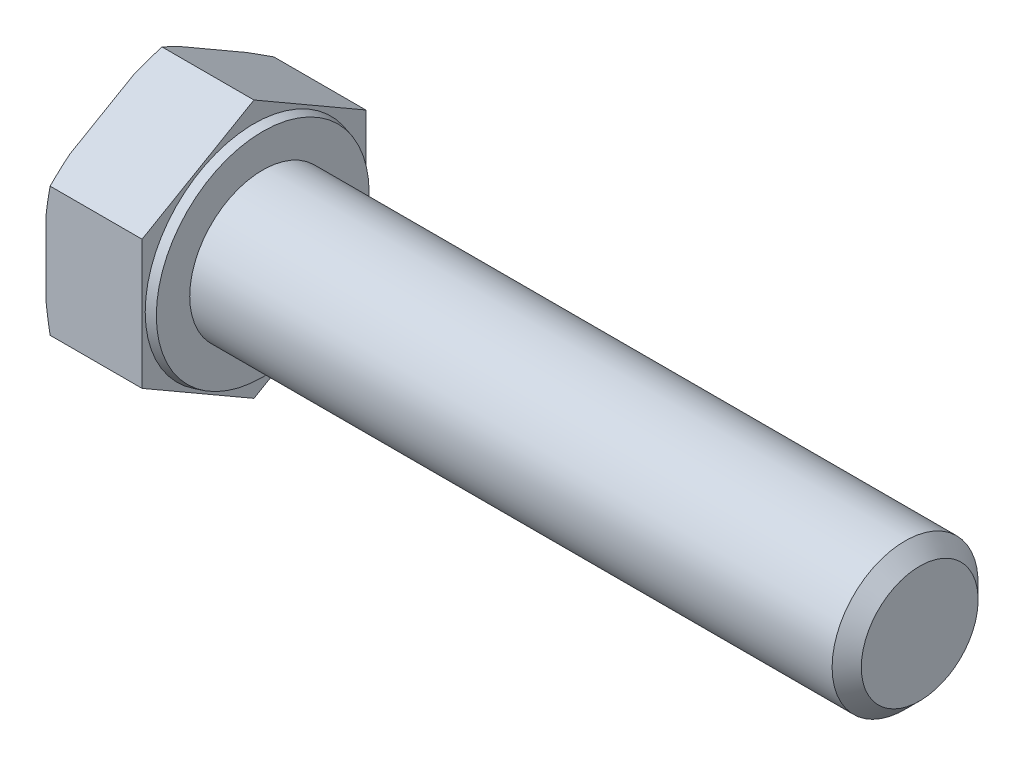
ISO-10303-21;
HEADER;
FILE_DESCRIPTION(('STEP AP214'),'2;1');
FILE_NAME('part.step','',(''),(''),'','','');
FILE_SCHEMA(('AUTOMOTIVE_DESIGN { 1 0 10303 214 1 1 1 1 }'));
ENDSEC;
DATA;
#1=APPLICATION_CONTEXT('core data for automotive mechanical design processes');
#2=APPLICATION_PROTOCOL_DEFINITION('international standard','automotive_design',2000,#1);
#3=PRODUCT_CONTEXT('',#1,'mechanical');
#4=PRODUCT('Part','Part','',(#3));
#5=PRODUCT_RELATED_PRODUCT_CATEGORY('part','',(#4));
#6=PRODUCT_DEFINITION_FORMATION('','',#4);
#7=PRODUCT_DEFINITION_CONTEXT('part definition',#1,'design');
#8=PRODUCT_DEFINITION('design','',#6,#7);
#9=PRODUCT_DEFINITION_SHAPE('','',#8);
#10=(LENGTH_UNIT() NAMED_UNIT(*) SI_UNIT(.MILLI.,.METRE.));
#11=(NAMED_UNIT(*) PLANE_ANGLE_UNIT() SI_UNIT($,.RADIAN.));
#12=(NAMED_UNIT(*) SI_UNIT($,.STERADIAN.) SOLID_ANGLE_UNIT());
#13=UNCERTAINTY_MEASURE_WITH_UNIT(LENGTH_MEASURE(1.E-05),#10,'distance_accuracy_value','');
#14=(GEOMETRIC_REPRESENTATION_CONTEXT(3) GLOBAL_UNCERTAINTY_ASSIGNED_CONTEXT((#13)) GLOBAL_UNIT_ASSIGNED_CONTEXT((#10,
#11,#12)) REPRESENTATION_CONTEXT('',''));
#15=CARTESIAN_POINT('',(0.,0.,0.));
#16=DIRECTION('',(0.,0.,1.));
#17=DIRECTION('',(1.,0.,0.));
#18=AXIS2_PLACEMENT_3D('',#15,#16,#17);
#19=CARTESIAN_POINT('',(45.6000000000001,-4.42500000000009,-7.66432482349223));
#20=DIRECTION('',(0.,-0.866025403784442,-0.499999999999995));
#21=DIRECTION('',(0.,0.499999999999995,-0.866025403784442));
#22=AXIS2_PLACEMENT_3D('',#19,#20,#21);
#23=PLANE('',#22);
#24=DIRECTION('',(-1.,0.,0.));
#25=VECTOR('',#24,1.);
#26=CARTESIAN_POINT('',(45.6000000000001,-8.85,0.));
#27=LINE('',#26,#25);
#28=CARTESIAN_POINT('',(0.,-8.85,0.));
#29=VERTEX_POINT('',#28);
#30=CARTESIAN_POINT('',(-6.29792306844368,-8.85,0.));
#31=VERTEX_POINT('',#30);
#32=EDGE_CURVE('E158',#29,#31,#27,.T.);
#33=ORIENTED_EDGE('',*,*,#32,.T.);
#34=CARTESIAN_POINT('',(-4.7699615006699,-11.9174022332107,5.3128965151713));
#35=CARTESIAN_POINT('',(-4.83614833570257,-11.8050473190038,5.11829209528478));
#36=CARTESIAN_POINT('',(-4.90167255003095,-11.6925948603644,4.92351872348535));
#37=CARTESIAN_POINT('',(-5.03118559698242,-11.4674663528304,4.53358471020429));
#38=CARTESIAN_POINT('',(-5.09517439305191,-11.3547902986816,4.33842405962226));
#39=CARTESIAN_POINT('',(-5.28456041407139,-11.0163157536771,3.75216895060564));
#40=CARTESIAN_POINT('',(-5.40733223857273,-10.7901468045144,3.3604328395613));
#41=CARTESIAN_POINT('',(-5.64480594732521,-10.3342684187143,2.57082831328319));
#42=CARTESIAN_POINT('',(-5.75941225873481,-10.1045464495324,2.17293819104533));
#43=CARTESIAN_POINT('',(-5.97591685440881,-9.6436033227612,1.37456127607789));
#44=CARTESIAN_POINT('',(-6.07781581130404,-9.41238224520545,0.974074621970503));
#45=CARTESIAN_POINT('',(-6.26134144326315,-8.95638364479249,0.184261877874948));
#46=CARTESIAN_POINT('',(-6.34355573274743,-8.73166601658844,-0.204960471530831));
#47=CARTESIAN_POINT('',(-6.48746045966097,-8.2805512783751,-0.986314118159493));
#48=CARTESIAN_POINT('',(-6.54915189984519,-8.05415425097466,-1.37844527229961));
#49=CARTESIAN_POINT('',(-6.62254434564547,-7.71410474496151,-1.9674282938031));
#50=CARTESIAN_POINT('',(-6.64378861584913,-7.60095958105454,-2.16340146632069));
#51=CARTESIAN_POINT('',(-6.67950592063896,-7.37440457175731,-2.55580625313272));
#52=CARTESIAN_POINT('',(-6.69397933196105,-7.26099474144627,-2.75223784130922));
#53=CARTESIAN_POINT('',(-6.7157765759338,-7.03401139991638,-3.14538452131075));
#54=CARTESIAN_POINT('',(-6.72310096885371,-6.92043790222291,-3.34209958970915));
#55=CARTESIAN_POINT('',(-6.73040192529392,-6.69323186195545,-3.73563199523894));
#56=CARTESIAN_POINT('',(-6.73037853713207,-6.57959931977464,-3.93244933168932));
#57=CARTESIAN_POINT('',(-6.72320871548941,-6.35929562962563,-4.31402651612232));
#58=CARTESIAN_POINT('',(-6.71649505277964,-6.25262090601261,-4.49879255730344));
#59=CARTESIAN_POINT('',(-6.69675463432834,-6.03941600442701,-4.86807427927243));
#60=CARTESIAN_POINT('',(-6.68372760236287,-5.93288583298343,-5.05258994875172));
#61=CARTESIAN_POINT('',(-6.63559663675346,-5.61363013252953,-5.60555704254388));
#62=CARTESIAN_POINT('',(-6.59144268713134,-5.40123548697151,-5.97343535990596));
#63=CARTESIAN_POINT('',(-6.48226269320506,-4.97681311893132,-6.70855646522027));
#64=CARTESIAN_POINT('',(-6.41713860156276,-4.7647919199632,-7.07578795411474));
#65=CARTESIAN_POINT('',(-6.27018625376656,-4.34222339340586,-7.80769811179158));
#66=CARTESIAN_POINT('',(-6.18835790112246,-4.1316760743376,-8.17237676581522));
#67=CARTESIAN_POINT('',(-6.00866271800198,-3.70472589760515,-8.91187616421634));
#68=CARTESIAN_POINT('',(-5.91033992742069,-3.48837165185492,-9.286612710289));
#69=CARTESIAN_POINT('',(-5.70311989656312,-3.05693413716248,-10.0338844060276));
#70=CARTESIAN_POINT('',(-5.59422212603359,-2.84185093252738,-10.4064194443103));
#71=CARTESIAN_POINT('',(-5.36943684134144,-2.41473283183158,-11.1462096955477));
#72=CARTESIAN_POINT('',(-5.25362330968472,-2.2026881429877,-11.5134818701005));
#73=CARTESIAN_POINT('',(-5.07537550670142,-1.88529185166037,-12.0632283728134));
#74=CARTESIAN_POINT('',(-5.01521325258259,-1.77961882394802,-12.2462594258008));
#75=CARTESIAN_POINT('',(-4.89354912869936,-1.56846779942573,-12.6119837283436));
#76=CARTESIAN_POINT('',(-4.83204728425027,-1.462989798971,-12.794676984212));
#77=CARTESIAN_POINT('',(-4.7699615006699,-1.35759776678936,-12.9772213386635));
#78=B_SPLINE_CURVE_WITH_KNOTS('',3,(#34,#35,#36,#37,#38,#39,#40,#41,#42,#43,#44,#45,#46,#47,#48,
#49,#50,#51,#52,#53,#54,#55,#56,#57,#58,#59,#60,#61,#62,#63,#64,#65,#66,#67,#68,#69,#70,#71,#72,
#73,#74,#75,#76,#77),.UNSPECIFIED.,.F.,.F.,(4,2,2,2,2,2,2,2,2,2,2,2,2,2,2,2,2,2,2,2,2,4),(0.,
0.70276173034238,1.40554017472233,2.81157217612387,4.23201032618944,5.6523732571052,
7.02270828812481,8.39297635416767,9.07474696516834,9.75647963740092,10.438158877887,
11.119833635759,11.7601005309412,12.4003954417532,13.6809617128842,14.9676044823533,
16.2542546841746,17.5852978857349,18.9164078632869,20.2352036230902,20.894426976119,
21.553637882061),.UNSPECIFIED.);
#79=CARTESIAN_POINT('',(-6.58000000000003,-7.90869530364146,-1.63038755949604));
#80=VERTEX_POINT('',#79);
#81=EDGE_CURVE('E203',#31,#80,#78,.T.);
#82=ORIENTED_EDGE('',*,*,#81,.T.);
#83=DIRECTION('',(0.,-0.499999999999995,0.866025403784442));
#84=VECTOR('',#83,1.);
#85=CARTESIAN_POINT('',(-6.58,-4.42500000000009,-7.66432482349223));
#86=LINE('',#85,#84);
#87=CARTESIAN_POINT('',(-6.58,-5.36630469635854,-6.03393726399618));
#88=VERTEX_POINT('',#87);
#89=EDGE_CURVE('E213',#88,#80,#86,.T.);
#90=ORIENTED_EDGE('',*,*,#89,.F.);
#91=CARTESIAN_POINT('',(-6.29792306844368,-4.42500000000009,-7.66432482349223));
#92=VERTEX_POINT('',#91);
#93=EDGE_CURVE('E216',#88,#92,#78,.T.);
#94=ORIENTED_EDGE('',*,*,#93,.T.);
#95=DIRECTION('',(-1.,0.,0.));
#96=VECTOR('',#95,1.);
#97=CARTESIAN_POINT('',(45.6000000000001,-4.42500000000009,-7.66432482349223));
#98=LINE('',#97,#96);
#99=CARTESIAN_POINT('',(0.,-4.42500000000009,-7.66432482349223));
#100=VERTEX_POINT('',#99);
#101=EDGE_CURVE('E169',#100,#92,#98,.T.);
#102=ORIENTED_EDGE('',*,*,#101,.F.);
#103=DIRECTION('',(0.,-0.499999999999995,0.866025403784442));
#104=VECTOR('',#103,1.);
#105=CARTESIAN_POINT('',(0.,-4.42500000000009,-7.66432482349223));
#106=LINE('',#105,#104);
#107=EDGE_CURVE('E184',#100,#29,#106,.T.);
#108=ORIENTED_EDGE('',*,*,#107,.T.);
#109=EDGE_LOOP('',(#33,#82,#90,#94,#102,#108));
#110=FACE_BOUND('',#109,.T.);
#111=ADVANCED_FACE('F36',(#110),#23,.T.);
#112=CARTESIAN_POINT('',(45.6000000000001,4.42499999999993,-7.66432482349232));
#113=DIRECTION('',(0.,0.,-1.));
#114=DIRECTION('',(0.,1.,0.));
#115=AXIS2_PLACEMENT_3D('',#112,#113,#114);
#116=PLANE('',#115);
#117=ORIENTED_EDGE('',*,*,#101,.T.);
#118=CARTESIAN_POINT('',(-5.00864005639831,-9.73789651517145,-7.66432482349217));
#119=CARTESIAN_POINT('',(-5.07003318744064,-9.52322769233334,-7.66432482349218));
#120=CARTESIAN_POINT('',(-5.13071664914256,-9.30835600664128,-7.66432482349218));
#121=CARTESIAN_POINT('',(-5.2504442425723,-8.87815277711283,-7.66432482349218));
#122=CARTESIAN_POINT('',(-5.30948834652955,-8.66282122555281,-7.66432482349219));
#123=CARTESIAN_POINT('',(-5.48387527888684,-8.01589307910885,-7.66432482349219));
#124=CARTESIAN_POINT('',(-5.59642298983084,-7.58353558067021,-7.6643248234922));
#125=CARTESIAN_POINT('',(-5.81266226723173,-6.71259000391773,-7.66432482349221));
#126=CARTESIAN_POINT('',(-5.91626806915323,-6.27398046842187,-7.66432482349221));
#127=CARTESIAN_POINT('',(-6.11029091280608,-5.39384656433909,-7.66432482349222));
#128=CARTESIAN_POINT('',(-6.20070892550878,-4.95232241284974,-7.66432482349222));
#129=CARTESIAN_POINT('',(-6.36160933963008,-4.08051166755351,-7.66432482349223));
#130=CARTESIAN_POINT('',(-6.43264625776086,-3.65032885049375,-7.66432482349224));
#131=CARTESIAN_POINT('',(-6.55428187483288,-2.78707107422335,-7.66432482349225));
#132=CARTESIAN_POINT('',(-6.60488453148917,-2.35399669158535,-7.66432482349225));
#133=CARTESIAN_POINT('',(-6.66240831794471,-1.70368188145931,-7.66432482349226));
#134=CARTESIAN_POINT('',(-6.67850532779577,-1.48723464984804,-7.66432482349226));
#135=CARTESIAN_POINT('',(-6.70429433272965,-1.05396299728827,-7.66432482349227));
#136=CARTESIAN_POINT('',(-6.71398664875919,-0.837138595786226,-7.66432482349227));
#137=CARTESIAN_POINT('',(-6.72672253024382,-0.403302294793051,-7.66432482349227));
#138=CARTESIAN_POINT('',(-6.72976638437883,-0.186290403852155,-7.66432482349227));
#139=CARTESIAN_POINT('',(-6.7291358967764,0.247718950123678,-7.66432482349228));
#140=CARTESIAN_POINT('',(-6.72546155695146,0.464716413162706,-7.66432482349228));
#141=CARTESIAN_POINT('',(-6.70624362970486,1.06036953223341,-7.66432482349229));
#142=CARTESIAN_POINT('',(-6.68388895075078,1.43882252598365,-7.66432482349229));
#143=CARTESIAN_POINT('',(-6.62050559151052,2.19412494594648,-7.6643248234923));
#144=CARTESIAN_POINT('',(-6.57947609181733,2.57097430106276,-7.6643248234923));
#145=CARTESIAN_POINT('',(-6.48113797206862,3.32388976987407,-7.66432482349231));
#146=CARTESIAN_POINT('',(-6.4237712185853,3.69994816672772,-7.66432482349232));
#147=CARTESIAN_POINT('',(-6.2956564145037,4.44978573942378,-7.66432482349232));
#148=CARTESIAN_POINT('',(-6.22490691200718,4.82356466341955,-7.66432482349233));
#149=CARTESIAN_POINT('',(-6.0704014797458,5.58003633732887,-7.66432482349234));
#150=CARTESIAN_POINT('',(-5.98632024183774,5.96266195818458,-7.66432482349234));
#151=CARTESIAN_POINT('',(-5.80919867667365,6.72583533235177,-7.66432482349235));
#152=CARTESIAN_POINT('',(-5.71615790531566,7.10638298167437,-7.66432482349235));
#153=CARTESIAN_POINT('',(-5.52374117974904,7.86297645537245,-7.66432482349236));
#154=CARTESIAN_POINT('',(-5.42441511026811,8.23903503370974,-7.66432482349236));
#155=CARTESIAN_POINT('',(-5.27134102225385,8.80195695976291,-7.66432482349237));
#156=CARTESIAN_POINT('',(-5.21964171692946,8.98938164843282,-7.66432482349237));
#157=CARTESIAN_POINT('',(-5.11502150400523,9.36388780999383,-7.66432482349237));
#158=CARTESIAN_POINT('',(-5.06210060924165,9.55096928646908,-7.66432482349238));
#159=CARTESIAN_POINT('',(-5.00864005639831,9.73789651517129,-7.66432482349238));
#160=B_SPLINE_CURVE_WITH_KNOTS('',3,(#118,#119,#120,#121,#122,#123,#124,#125,#126,#127,#128,
#129,#130,#131,#132,#133,#134,#135,#136,#137,#138,#139,#140,#141,#142,#143,#144,#145,#146,#147,
#148,#149,#150,#151,#152,#153,#154,#155,#156,#157,#158,#159),.UNSPECIFIED.,.F.,.F.,(4,2,2,2,2,2,
2,2,2,2,2,2,2,2,2,2,2,2,2,2,4),(0.,0.669823290546161,1.33965792092904,2.67986595636369,
4.03175825312792,5.38355096443301,6.69120700403605,7.99860965473741,8.64966414612008,
9.300686009923,9.95167960543101,10.6026730156168,11.7394565125237,12.876289893615,
14.0172201663474,15.1582742899967,16.3334026116279,17.5085892114817,18.6753990362947,
19.2586689197893,19.8419326771629),.UNSPECIFIED.);
#161=CARTESIAN_POINT('',(-6.58000000000003,-2.54239060728318,-7.66432482349217));
#162=VERTEX_POINT('',#161);
#163=EDGE_CURVE('E224',#92,#162,#160,.T.);
#164=ORIENTED_EDGE('',*,*,#163,.T.);
#165=DIRECTION('',(0.,-1.,0.));
#166=VECTOR('',#165,1.);
#167=CARTESIAN_POINT('',(-6.58,4.42499999999993,-7.66432482349232));
#168=LINE('',#167,#166);
#169=CARTESIAN_POINT('',(-6.58,2.54239060728305,-7.6643248234923));
#170=VERTEX_POINT('',#169);
#171=EDGE_CURVE('E164',#170,#162,#168,.T.);
#172=ORIENTED_EDGE('',*,*,#171,.F.);
#173=CARTESIAN_POINT('',(-6.29792306844368,4.42499999999993,-7.66432482349232));
#174=VERTEX_POINT('',#173);
#175=EDGE_CURVE('E51',#170,#174,#160,.T.);
#176=ORIENTED_EDGE('',*,*,#175,.T.);
#177=DIRECTION('',(-1.,0.,0.));
#178=VECTOR('',#177,1.);
#179=CARTESIAN_POINT('',(45.6000000000001,4.42499999999993,-7.66432482349232));
#180=LINE('',#179,#178);
#181=CARTESIAN_POINT('',(0.,4.42499999999993,-7.66432482349232));
#182=VERTEX_POINT('',#181);
#183=EDGE_CURVE('E155',#182,#174,#180,.T.);
#184=ORIENTED_EDGE('',*,*,#183,.F.);
#185=DIRECTION('',(0.,-1.,0.));
#186=VECTOR('',#185,1.);
#187=CARTESIAN_POINT('',(0.,8.84999999999992,-7.66432482349237));
#188=LINE('',#187,#186);
#189=EDGE_CURVE('E182',#182,#100,#188,.T.);
#190=ORIENTED_EDGE('',*,*,#189,.T.);
#191=EDGE_LOOP('',(#117,#164,#172,#176,#184,#190));
#192=FACE_BOUND('',#191,.T.);
#193=ADVANCED_FACE('F251',(#192),#116,.T.);
#194=CARTESIAN_POINT('',(45.6000000000001,8.85,0.));
#195=DIRECTION('',(0.,0.866025403784434,-0.500000000000007));
#196=DIRECTION('',(0.,0.500000000000007,0.866025403784435));
#197=AXIS2_PLACEMENT_3D('',#194,#195,#196);
#198=PLANE('',#197);
#199=ORIENTED_EDGE('',*,*,#183,.T.);
#200=CARTESIAN_POINT('',(-4.76996150066986,1.35759776678906,-12.9772213386637));
#201=CARTESIAN_POINT('',(-4.83614833570253,1.46995268099604,-12.7826169187772));
#202=CARTESIAN_POINT('',(-4.9016725500309,1.58240513963541,-12.5878435469777));
#203=CARTESIAN_POINT('',(-5.03118559698238,1.80753364716942,-12.1979095336967));
#204=CARTESIAN_POINT('',(-5.09517439305187,1.92020970131819,-12.0027488831146));
#205=CARTESIAN_POINT('',(-5.28456041407135,2.25868424632273,-11.416493774098));
#206=CARTESIAN_POINT('',(-5.40733223857269,2.48485319548548,-11.0247576630537));
#207=CARTESIAN_POINT('',(-5.64480594732518,2.94073158128551,-10.2351531367756));
#208=CARTESIAN_POINT('',(-5.75941225873478,3.17045355046743,-9.83726301453771));
#209=CARTESIAN_POINT('',(-5.97591685440879,3.63139667723867,-9.03888609957028));
#210=CARTESIAN_POINT('',(-6.07781581130402,3.86261775479443,-8.63839944546289));
#211=CARTESIAN_POINT('',(-6.26134144326313,4.3186163552074,-7.84858670136733));
#212=CARTESIAN_POINT('',(-6.34355573274742,4.54333398341145,-7.45936435196155));
#213=CARTESIAN_POINT('',(-6.48746045966097,4.99444872162482,-6.67801070533289));
#214=CARTESIAN_POINT('',(-6.54915189984519,5.22084574902526,-6.28587955119277));
#215=CARTESIAN_POINT('',(-6.62254434564547,5.56089525503842,-5.69689652968929));
#216=CARTESIAN_POINT('',(-6.64378861584913,5.6740404189454,-5.5009233571717));
#217=CARTESIAN_POINT('',(-6.67950592063896,5.90059542824263,-5.10851857035966));
#218=CARTESIAN_POINT('',(-6.69397933196106,6.01400525855368,-4.91208698218317));
#219=CARTESIAN_POINT('',(-6.7157765759338,6.24098860008357,-4.51894030218163));
#220=CARTESIAN_POINT('',(-6.72310096885372,6.35456209777704,-4.32222523378324));
#221=CARTESIAN_POINT('',(-6.73040192529394,6.58176813804451,-3.92869282825345));
#222=CARTESIAN_POINT('',(-6.73037853713208,6.69540068022533,-3.73187549180306));
#223=CARTESIAN_POINT('',(-6.72320871548943,6.91570437037435,-3.35029830737006));
#224=CARTESIAN_POINT('',(-6.71649505277966,7.02237909398737,-3.16553226618894));
#225=CARTESIAN_POINT('',(-6.69675463432836,7.23558399557298,-2.79625054421994));
#226=CARTESIAN_POINT('',(-6.68372760236289,7.34211416701656,-2.61173487474064));
#227=CARTESIAN_POINT('',(-6.63559663675348,7.66136986747048,-2.05876778094847));
#228=CARTESIAN_POINT('',(-6.59144268713136,7.87376451302852,-1.69088946358639));
#229=CARTESIAN_POINT('',(-6.48226269320508,8.29818688106872,-0.955768358272067));
#230=CARTESIAN_POINT('',(-6.41713860156277,8.51020808003686,-0.588536869377594));
#231=CARTESIAN_POINT('',(-6.27018625376657,8.93277660659422,0.143373288299262));
#232=CARTESIAN_POINT('',(-6.18835790112246,9.14332392566248,0.508051942322907));
#233=CARTESIAN_POINT('',(-6.00866271800198,9.57027410239495,1.24755134072404));
#234=CARTESIAN_POINT('',(-5.91033992742068,9.7866283481452,1.62228788679671));
#235=CARTESIAN_POINT('',(-5.7031198965631,10.2180658628377,2.36955958253528));
#236=CARTESIAN_POINT('',(-5.59422212603357,10.4331490674728,2.74209462081801));
#237=CARTESIAN_POINT('',(-5.36943684134141,10.8602671681686,3.48188487205548));
#238=CARTESIAN_POINT('',(-5.25362330968469,11.0723118570125,3.84915704660823));
#239=CARTESIAN_POINT('',(-5.07537550670138,11.3897081483398,4.39890354932111));
#240=CARTESIAN_POINT('',(-5.01521325258256,11.4953811760522,4.58193460230855));
#241=CARTESIAN_POINT('',(-4.89354912869931,11.7065322005745,4.94765890485139));
#242=CARTESIAN_POINT('',(-4.83204728425022,11.8120102010292,5.13035216071975));
#243=CARTESIAN_POINT('',(-4.76996150066986,11.9174022332109,5.3128965151713));
#244=B_SPLINE_CURVE_WITH_KNOTS('',3,(#200,#201,#202,#203,#204,#205,#206,#207,#208,#209,#210,
#211,#212,#213,#214,#215,#216,#217,#218,#219,#220,#221,#222,#223,#224,#225,#226,#227,#228,#229,
#230,#231,#232,#233,#234,#235,#236,#237,#238,#239,#240,#241,#242,#243),.UNSPECIFIED.,.F.,.F.,(4,
2,2,2,2,2,2,2,2,2,2,2,2,2,2,2,2,2,2,2,2,4),(0.,0.702761730342387,1.40554017472235,
2.8115721761239,4.23201032618948,5.65237325710526,7.02270828812488,8.39297635416775,
9.07474696516843,9.75647963740101,10.4381588778871,11.1198336357591,11.7601005309413,
12.4003954417533,13.6809617128843,14.9676044823535,16.2542546841748,17.5852978857351,
18.9164078632872,20.2352036230905,20.8944269761194,21.5536378820614),.UNSPECIFIED.);
#245=CARTESIAN_POINT('',(-6.58000000000003,5.36630469635833,-6.03393726399625));
#246=VERTEX_POINT('',#245);
#247=EDGE_CURVE('E246',#174,#246,#244,.T.);
#248=ORIENTED_EDGE('',*,*,#247,.T.);
#249=DIRECTION('',(0.,-0.500000000000007,-0.866025403784435));
#250=VECTOR('',#249,1.);
#251=CARTESIAN_POINT('',(-6.58,8.85,0.));
#252=LINE('',#251,#250);
#253=CARTESIAN_POINT('',(-6.58,7.90869530364155,-1.63038755949607));
#254=VERTEX_POINT('',#253);
#255=EDGE_CURVE('E236',#254,#246,#252,.T.);
#256=ORIENTED_EDGE('',*,*,#255,.F.);
#257=CARTESIAN_POINT('',(-6.29792306844368,8.85,0.));
#258=VERTEX_POINT('',#257);
#259=EDGE_CURVE('E59',#254,#258,#244,.T.);
#260=ORIENTED_EDGE('',*,*,#259,.T.);
#261=DIRECTION('',(-1.,0.,0.));
#262=VECTOR('',#261,1.);
#263=CARTESIAN_POINT('',(45.6000000000001,8.85,0.));
#264=LINE('',#263,#262);
#265=CARTESIAN_POINT('',(0.,8.85,0.));
#266=VERTEX_POINT('',#265);
#267=EDGE_CURVE('E152',#266,#258,#264,.T.);
#268=ORIENTED_EDGE('',*,*,#267,.F.);
#269=DIRECTION('',(0.,-0.500000000000007,-0.866025403784435));
#270=VECTOR('',#269,1.);
#271=CARTESIAN_POINT('',(0.,8.85000000000003,0.));
#272=LINE('',#271,#270);
#273=EDGE_CURVE('E180',#266,#182,#272,.T.);
#274=ORIENTED_EDGE('',*,*,#273,.T.);
#275=EDGE_LOOP('',(#199,#248,#256,#260,#268,#274));
#276=FACE_BOUND('',#275,.T.);
#277=ADVANCED_FACE('F244',(#276),#198,.T.);
#278=CARTESIAN_POINT('',(45.6000000000001,4.42500000000004,7.66432482349226));
#279=DIRECTION('',(0.,0.866025403784442,0.499999999999995));
#280=DIRECTION('',(0.,-0.499999999999995,0.866025403784442));
#281=AXIS2_PLACEMENT_3D('',#278,#279,#280);
#282=PLANE('',#281);
#283=ORIENTED_EDGE('',*,*,#267,.T.);
#284=CARTESIAN_POINT('',(-4.76996150066987,11.9174022332108,-5.31289651517143));
#285=CARTESIAN_POINT('',(-4.83614833570254,11.8050473190038,-5.1182920952849));
#286=CARTESIAN_POINT('',(-4.90167255003092,11.6925948603644,-4.92351872348547));
#287=CARTESIAN_POINT('',(-5.03118559698239,11.4674663528304,-4.53358471020441));
#288=CARTESIAN_POINT('',(-5.09517439305188,11.3547902986817,-4.33842405962238));
#289=CARTESIAN_POINT('',(-5.28456041407136,11.0163157536771,-3.75216895060575));
#290=CARTESIAN_POINT('',(-5.4073322385727,10.7901468045144,-3.36043283956141));
#291=CARTESIAN_POINT('',(-5.64480594732519,10.3342684187144,-2.5708283132833));
#292=CARTESIAN_POINT('',(-5.75941225873479,10.1045464495324,-2.17293819104543));
#293=CARTESIAN_POINT('',(-5.9759168544088,9.64360332276122,-1.374561276078));
#294=CARTESIAN_POINT('',(-6.07781581130403,9.41238224520547,-0.974074621970605));
#295=CARTESIAN_POINT('',(-6.26134144326314,8.95638364479251,-0.184261877875046));
#296=CARTESIAN_POINT('',(-6.34355573274742,8.73166601658846,0.204960471530736));
#297=CARTESIAN_POINT('',(-6.48746045966097,8.28055127837511,0.986314118159403));
#298=CARTESIAN_POINT('',(-6.54915189984519,8.05415425097468,1.37844527229953));
#299=CARTESIAN_POINT('',(-6.62254434564547,7.71410474496153,1.96742829380301));
#300=CARTESIAN_POINT('',(-6.64378861584913,7.60095958105455,2.1634014663206));
#301=CARTESIAN_POINT('',(-6.67950592063896,7.37440457175733,2.55580625313264));
#302=CARTESIAN_POINT('',(-6.69397933196106,7.26099474144628,2.75223784130914));
#303=CARTESIAN_POINT('',(-6.71577657593381,7.03401139991639,3.14538452131067));
#304=CARTESIAN_POINT('',(-6.72310096885372,6.92043790222292,3.34209958970907));
#305=CARTESIAN_POINT('',(-6.73040192529394,6.69323186195546,3.73563199523886));
#306=CARTESIAN_POINT('',(-6.73037853713208,6.57959931977464,3.93244933168925));
#307=CARTESIAN_POINT('',(-6.72320871548943,6.35929562962563,4.31402651612225));
#308=CARTESIAN_POINT('',(-6.71649505277966,6.25262090601261,4.49879255730338));
#309=CARTESIAN_POINT('',(-6.69675463432836,6.03941600442701,4.86807427927237));
#310=CARTESIAN_POINT('',(-6.68372760236289,5.93288583298343,5.05258994875167));
#311=CARTESIAN_POINT('',(-6.63559663675348,5.61363013252952,5.60555704254384));
#312=CARTESIAN_POINT('',(-6.59144268713136,5.40123548697149,5.97343535990593));
#313=CARTESIAN_POINT('',(-6.48226269320508,4.9768131189313,6.70855646522025));
#314=CARTESIAN_POINT('',(-6.41713860156277,4.76479191996317,7.07578795411472));
#315=CARTESIAN_POINT('',(-6.27018625376657,4.34222339340582,7.80769811179158));
#316=CARTESIAN_POINT('',(-6.18835790112247,4.13167607433756,8.17237676581522));
#317=CARTESIAN_POINT('',(-6.00866271800198,3.70472589760511,8.91187616421636));
#318=CARTESIAN_POINT('',(-5.91033992742068,3.48837165185487,9.28661271028903));
#319=CARTESIAN_POINT('',(-5.70311989656311,3.05693413716242,10.0338844060276));
#320=CARTESIAN_POINT('',(-5.59422212603358,2.84185093252732,10.4064194443103));
#321=CARTESIAN_POINT('',(-5.36943684134142,2.41473283183151,11.1462096955478));
#322=CARTESIAN_POINT('',(-5.2536233096847,2.20268814298762,11.5134818701006));
#323=CARTESIAN_POINT('',(-5.07537550670139,1.88529185166029,12.0632283728134));
#324=CARTESIAN_POINT('',(-5.01521325258257,1.77961882394793,12.2462594258009));
#325=CARTESIAN_POINT('',(-4.89354912869933,1.56846779942564,12.6119837283437));
#326=CARTESIAN_POINT('',(-4.83204728425023,1.46298979897091,12.7946769842121));
#327=CARTESIAN_POINT('',(-4.76996150066987,1.35759776678926,12.9772213386636));
#328=B_SPLINE_CURVE_WITH_KNOTS('',3,(#284,#285,#286,#287,#288,#289,#290,#291,#292,#293,#294,
#295,#296,#297,#298,#299,#300,#301,#302,#303,#304,#305,#306,#307,#308,#309,#310,#311,#312,#313,
#314,#315,#316,#317,#318,#319,#320,#321,#322,#323,#324,#325,#326,#327),.UNSPECIFIED.,.F.,.F.,(4,
2,2,2,2,2,2,2,2,2,2,2,2,2,2,2,2,2,2,2,2,4),(0.,0.702761730342384,1.40554017472234,
2.81157217612389,4.23201032618947,5.65237325710524,7.02270828812486,8.39297635416772,
9.07474696516839,9.75647963740098,10.4381588778871,11.119833635759,11.7601005309412,
12.4003954417533,13.6809617128843,14.9676044823535,16.2542546841747,17.5852978857351,
18.9164078632871,20.2352036230904,20.8944269761193,21.5536378820613),.UNSPECIFIED.);
#329=CARTESIAN_POINT('',(-6.58000000000003,7.90869530364148,1.63038755949594));
#330=VERTEX_POINT('',#329);
#331=EDGE_CURVE('E146',#258,#330,#328,.T.);
#332=ORIENTED_EDGE('',*,*,#331,.T.);
#333=DIRECTION('',(0.,0.499999999999995,-0.866025403784442));
#334=VECTOR('',#333,1.);
#335=CARTESIAN_POINT('',(-6.58,4.42500000000004,7.66432482349226));
#336=LINE('',#335,#334);
#337=CARTESIAN_POINT('',(-6.58,5.36630469635847,6.03393726399624));
#338=VERTEX_POINT('',#337);
#339=EDGE_CURVE('E145',#338,#330,#336,.T.);
#340=ORIENTED_EDGE('',*,*,#339,.F.);
#341=CARTESIAN_POINT('',(-6.29792306844368,4.42500000000004,7.66432482349226));
#342=VERTEX_POINT('',#341);
#343=EDGE_CURVE('E127',#338,#342,#328,.T.);
#344=ORIENTED_EDGE('',*,*,#343,.T.);
#345=DIRECTION('',(-1.,0.,0.));
#346=VECTOR('',#345,1.);
#347=CARTESIAN_POINT('',(45.6000000000001,4.42500000000004,7.66432482349226));
#348=LINE('',#347,#346);
#349=CARTESIAN_POINT('',(0.,4.42500000000004,7.66432482349226));
#350=VERTEX_POINT('',#349);
#351=EDGE_CURVE('E141',#350,#342,#348,.T.);
#352=ORIENTED_EDGE('',*,*,#351,.F.);
#353=DIRECTION('',(0.,0.499999999999995,-0.866025403784442));
#354=VECTOR('',#353,1.);
#355=CARTESIAN_POINT('',(0.,8.84999999999997,0.));
#356=LINE('',#355,#354);
#357=EDGE_CURVE('E178',#350,#266,#356,.T.);
#358=ORIENTED_EDGE('',*,*,#357,.T.);
#359=EDGE_LOOP('',(#283,#332,#340,#344,#352,#358));
#360=FACE_BOUND('',#359,.T.);
#361=ADVANCED_FACE('F140',(#360),#282,.T.);
#362=CARTESIAN_POINT('',(45.6000000000001,-4.42499999999998,7.66432482349229));
#363=DIRECTION('',(0.,0.,1.));
#364=DIRECTION('',(0.,-1.,0.));
#365=AXIS2_PLACEMENT_3D('',#362,#363,#364);
#366=PLANE('',#365);
#367=ORIENTED_EDGE('',*,*,#351,.T.);
#368=CARTESIAN_POINT('',(-5.00864005639831,9.7378965151714,7.66432482349224));
#369=CARTESIAN_POINT('',(-5.07003318744064,9.52322769233328,7.66432482349224));
#370=CARTESIAN_POINT('',(-5.13071664914256,9.30835600664122,7.66432482349224));
#371=CARTESIAN_POINT('',(-5.2504442425723,8.87815277711278,7.66432482349225));
#372=CARTESIAN_POINT('',(-5.30948834652955,8.66282122555276,7.66432482349225));
#373=CARTESIAN_POINT('',(-5.48387527888684,8.0158930791088,7.66432482349225));
#374=CARTESIAN_POINT('',(-5.59642298983084,7.58353558067016,7.66432482349225));
#375=CARTESIAN_POINT('',(-5.81266226723173,6.71259000391768,7.66432482349225));
#376=CARTESIAN_POINT('',(-5.91626806915323,6.27398046842182,7.66432482349225));
#377=CARTESIAN_POINT('',(-6.11029091280608,5.39384656433903,7.66432482349226));
#378=CARTESIAN_POINT('',(-6.20070892550878,4.95232241284969,7.66432482349226));
#379=CARTESIAN_POINT('',(-6.36160933963008,4.08051166755345,7.66432482349226));
#380=CARTESIAN_POINT('',(-6.43264625776087,3.6503288504937,7.66432482349226));
#381=CARTESIAN_POINT('',(-6.55428187483288,2.7870710742233,7.66432482349227));
#382=CARTESIAN_POINT('',(-6.60488453148917,2.3539966915853,7.66432482349227));
#383=CARTESIAN_POINT('',(-6.66240831794471,1.70368188145926,7.66432482349227));
#384=CARTESIAN_POINT('',(-6.67850532779577,1.48723464984798,7.66432482349227));
#385=CARTESIAN_POINT('',(-6.70429433272965,1.05396299728821,7.66432482349227));
#386=CARTESIAN_POINT('',(-6.71398664875919,0.83713859578617,7.66432482349227));
#387=CARTESIAN_POINT('',(-6.72672253024382,0.403302294792995,7.66432482349227));
#388=CARTESIAN_POINT('',(-6.72976638437883,0.1862904038521,7.66432482349228));
#389=CARTESIAN_POINT('',(-6.7291358967764,-0.247718950123733,7.66432482349228));
#390=CARTESIAN_POINT('',(-6.72546155695146,-0.46471641316276,7.66432482349228));
#391=CARTESIAN_POINT('',(-6.70624362970486,-1.06036953223346,7.66432482349228));
#392=CARTESIAN_POINT('',(-6.68388895075078,-1.43882252598371,7.66432482349228));
#393=CARTESIAN_POINT('',(-6.62050559151052,-2.19412494594653,7.66432482349228));
#394=CARTESIAN_POINT('',(-6.57947609181733,-2.57097430106281,7.66432482349229));
#395=CARTESIAN_POINT('',(-6.48113797206862,-3.32388976987413,7.66432482349229));
#396=CARTESIAN_POINT('',(-6.4237712185853,-3.69994816672777,7.66432482349229));
#397=CARTESIAN_POINT('',(-6.2956564145037,-4.44978573942384,7.66432482349229));
#398=CARTESIAN_POINT('',(-6.22490691200718,-4.8235646634196,7.66432482349229));
#399=CARTESIAN_POINT('',(-6.0704014797458,-5.58003633732892,7.6643248234923));
#400=CARTESIAN_POINT('',(-5.98632024183774,-5.96266195818463,7.6643248234923));
#401=CARTESIAN_POINT('',(-5.80919867667365,-6.72583533235183,7.6643248234923));
#402=CARTESIAN_POINT('',(-5.71615790531566,-7.10638298167442,7.6643248234923));
#403=CARTESIAN_POINT('',(-5.52374117974904,-7.8629764553725,7.66432482349231));
#404=CARTESIAN_POINT('',(-5.42441511026811,-8.2390350337098,7.66432482349231));
#405=CARTESIAN_POINT('',(-5.27134102225385,-8.80195695976297,7.66432482349231));
#406=CARTESIAN_POINT('',(-5.21964171692946,-8.98938164843288,7.66432482349231));
#407=CARTESIAN_POINT('',(-5.11502150400523,-9.36388780999389,7.66432482349231));
#408=CARTESIAN_POINT('',(-5.06210060924165,-9.55096928646914,7.66432482349231));
#409=CARTESIAN_POINT('',(-5.00864005639831,-9.73789651517135,7.66432482349231));
#410=B_SPLINE_CURVE_WITH_KNOTS('',3,(#368,#369,#370,#371,#372,#373,#374,#375,#376,#377,#378,
#379,#380,#381,#382,#383,#384,#385,#386,#387,#388,#389,#390,#391,#392,#393,#394,#395,#396,#397,
#398,#399,#400,#401,#402,#403,#404,#405,#406,#407,#408,#409),.UNSPECIFIED.,.F.,.F.,(4,2,2,2,2,2,
2,2,2,2,2,2,2,2,2,2,2,2,2,2,4),(0.,0.669823290546161,1.33965792092904,2.67986595636369,
4.03175825312792,5.38355096443301,6.69120700403605,7.99860965473742,8.64966414612009,
9.300686009923,9.95167960543102,10.6026730156168,11.7394565125237,12.876289893615,
14.0172201663474,15.1582742899967,16.3334026116279,17.5085892114817,18.6753990362947,
19.2586689197893,19.8419326771629),.UNSPECIFIED.);
#411=CARTESIAN_POINT('',(-6.58000000000003,2.54239060728313,7.66432482349219));
#412=VERTEX_POINT('',#411);
#413=EDGE_CURVE('E124',#342,#412,#410,.T.);
#414=ORIENTED_EDGE('',*,*,#413,.T.);
#415=DIRECTION('',(0.,1.,0.));
#416=VECTOR('',#415,1.);
#417=CARTESIAN_POINT('',(-6.58,-4.42499999999998,7.66432482349229));
#418=LINE('',#417,#416);
#419=CARTESIAN_POINT('',(-6.58,-2.5423906072831,7.66432482349229));
#420=VERTEX_POINT('',#419);
#421=EDGE_CURVE('E222',#420,#412,#418,.T.);
#422=ORIENTED_EDGE('',*,*,#421,.F.);
#423=CARTESIAN_POINT('',(-6.29792306844368,-4.42499999999998,7.66432482349229));
#424=VERTEX_POINT('',#423);
#425=EDGE_CURVE('E134',#420,#424,#410,.T.);
#426=ORIENTED_EDGE('',*,*,#425,.T.);
#427=DIRECTION('',(-1.,0.,0.));
#428=VECTOR('',#427,1.);
#429=CARTESIAN_POINT('',(45.6000000000001,-4.42499999999998,7.66432482349229));
#430=LINE('',#429,#428);
#431=CARTESIAN_POINT('',(0.,-4.42499999999998,7.66432482349229));
#432=VERTEX_POINT('',#431);
#433=EDGE_CURVE('E153',#432,#424,#430,.T.);
#434=ORIENTED_EDGE('',*,*,#433,.F.);
#435=DIRECTION('',(0.,1.,0.));
#436=VECTOR('',#435,1.);
#437=CARTESIAN_POINT('',(0.,8.85000000000003,7.66432482349225));
#438=LINE('',#437,#436);
#439=EDGE_CURVE('E151',#432,#350,#438,.T.);
#440=ORIENTED_EDGE('',*,*,#439,.T.);
#441=EDGE_LOOP('',(#367,#414,#422,#426,#434,#440));
#442=FACE_BOUND('',#441,.T.);
#443=ADVANCED_FACE('F148',(#442),#366,.T.);
#444=CARTESIAN_POINT('',(45.6000000000001,-8.85,0.));
#445=DIRECTION('',(0.,-0.866025403784438,0.500000000000001));
#446=DIRECTION('',(0.,-0.500000000000001,-0.866025403784438));
#447=AXIS2_PLACEMENT_3D('',#444,#445,#446);
#448=PLANE('',#447);
#449=ORIENTED_EDGE('',*,*,#433,.T.);
#450=CARTESIAN_POINT('',(-4.76996150066987,-1.35759776678916,12.9772213386637));
#451=CARTESIAN_POINT('',(-4.83614833570253,-1.46995268099614,12.7826169187771));
#452=CARTESIAN_POINT('',(-4.90167255003091,-1.58240513963551,12.5878435469777));
#453=CARTESIAN_POINT('',(-5.03118559698239,-1.80753364716952,12.1979095336966));
#454=CARTESIAN_POINT('',(-5.09517439305187,-1.92020970131828,12.0027488831146));
#455=CARTESIAN_POINT('',(-5.28456041407135,-2.25868424632282,11.416493774098));
#456=CARTESIAN_POINT('',(-5.4073322385727,-2.48485319548557,11.0247576630537));
#457=CARTESIAN_POINT('',(-5.64480594732518,-2.94073158128559,10.2351531367755));
#458=CARTESIAN_POINT('',(-5.75941225873479,-3.17045355046751,9.83726301453767));
#459=CARTESIAN_POINT('',(-5.97591685440879,-3.63139667723874,9.03888609957024));
#460=CARTESIAN_POINT('',(-6.07781581130402,-3.8626177547945,8.63839944546285));
#461=CARTESIAN_POINT('',(-6.26134144326314,-4.31861635520747,7.84858670136729));
#462=CARTESIAN_POINT('',(-6.34355573274742,-4.54333398341151,7.45936435196151));
#463=CARTESIAN_POINT('',(-6.48746045966097,-4.99444872162487,6.67801070533285));
#464=CARTESIAN_POINT('',(-6.54915189984519,-5.22084574902531,6.28587955119272));
#465=CARTESIAN_POINT('',(-6.62254434564547,-5.56089525503846,5.69689652968924));
#466=CARTESIAN_POINT('',(-6.64378861584913,-5.67404041894544,5.50092335717165));
#467=CARTESIAN_POINT('',(-6.67950592063896,-5.90059542824267,5.10851857035961));
#468=CARTESIAN_POINT('',(-6.69397933196106,-6.01400525855372,4.91208698218311));
#469=CARTESIAN_POINT('',(-6.7157765759338,-6.24098860008361,4.51894030218158));
#470=CARTESIAN_POINT('',(-6.72310096885372,-6.35456209777708,4.32222523378318));
#471=CARTESIAN_POINT('',(-6.73040192529394,-6.58176813804454,3.92869282825339));
#472=CARTESIAN_POINT('',(-6.73037853713208,-6.69540068022536,3.73187549180301));
#473=CARTESIAN_POINT('',(-6.72320871548943,-6.91570437037438,3.35029830737));
#474=CARTESIAN_POINT('',(-6.71649505277966,-7.0223790939874,3.16553226618888));
#475=CARTESIAN_POINT('',(-6.69675463432836,-7.23558399557301,2.79625054421989));
#476=CARTESIAN_POINT('',(-6.68372760236289,-7.34211416701659,2.61173487474059));
#477=CARTESIAN_POINT('',(-6.63559663675348,-7.6613698674705,2.05876778094842));
#478=CARTESIAN_POINT('',(-6.59144268713136,-7.87376451302853,1.69088946358633));
#479=CARTESIAN_POINT('',(-6.48226269320508,-8.29818688106873,0.955768358272009));
#480=CARTESIAN_POINT('',(-6.41713860156277,-8.51020808003686,0.588536869377536));
#481=CARTESIAN_POINT('',(-6.27018625376657,-8.93277660659422,-0.14337328829932));
#482=CARTESIAN_POINT('',(-6.18835790112247,-9.14332392566248,-0.508051942322964));
#483=CARTESIAN_POINT('',(-6.00866271800198,-9.57027410239494,-1.2475513407241));
#484=CARTESIAN_POINT('',(-5.91033992742068,-9.78662834814519,-1.62228788679677));
#485=CARTESIAN_POINT('',(-5.7031198965631,-10.2180658628376,-2.36955958253534));
#486=CARTESIAN_POINT('',(-5.59422212603357,-10.4331490674727,-2.74209462081808));
#487=CARTESIAN_POINT('',(-5.36943684134142,-10.8602671681686,-3.48188487205554));
#488=CARTESIAN_POINT('',(-5.25362330968469,-11.0723118570124,-3.84915704660829));
#489=CARTESIAN_POINT('',(-5.07537550670139,-11.3897081483398,-4.39890354932117));
#490=CARTESIAN_POINT('',(-5.01521325258256,-11.4953811760521,-4.58193460230861));
#491=CARTESIAN_POINT('',(-4.89354912869932,-11.7065322005744,-4.94765890485145));
#492=CARTESIAN_POINT('',(-4.83204728425023,-11.8120102010292,-5.13035216071981));
#493=CARTESIAN_POINT('',(-4.76996150066987,-11.9174022332108,-5.31289651517136));
#494=B_SPLINE_CURVE_WITH_KNOTS('',3,(#450,#451,#452,#453,#454,#455,#456,#457,#458,#459,#460,
#461,#462,#463,#464,#465,#466,#467,#468,#469,#470,#471,#472,#473,#474,#475,#476,#477,#478,#479,
#480,#481,#482,#483,#484,#485,#486,#487,#488,#489,#490,#491,#492,#493),.UNSPECIFIED.,.F.,.F.,(4,
2,2,2,2,2,2,2,2,2,2,2,2,2,2,2,2,2,2,2,2,4),(0.,0.702761730342388,1.40554017472235,
2.81157217612389,4.23201032618948,5.65237325710525,7.02270828812487,8.39297635416773,
9.07474696516841,9.756479637401,10.4381588778871,11.1198336357591,11.7601005309413,
12.4003954417533,13.6809617128843,14.9676044823535,16.2542546841747,17.5852978857351,
18.9164078632871,20.2352036230905,20.8944269761193,21.5536378820613),.UNSPECIFIED.);
#495=CARTESIAN_POINT('',(-6.58000000000003,-5.36630469635837,6.03393726399621));
#496=VERTEX_POINT('',#495);
#497=EDGE_CURVE('E214',#424,#496,#494,.T.);
#498=ORIENTED_EDGE('',*,*,#497,.T.);
#499=DIRECTION('',(0.,0.500000000000001,0.866025403784438));
#500=VECTOR('',#499,1.);
#501=CARTESIAN_POINT('',(-6.58,-8.85,0.));
#502=LINE('',#501,#500);
#503=CARTESIAN_POINT('',(-6.58,-7.90869530364156,1.63038755949602));
#504=VERTEX_POINT('',#503);
#505=EDGE_CURVE('E220',#504,#496,#502,.T.);
#506=ORIENTED_EDGE('',*,*,#505,.F.);
#507=EDGE_CURVE('E205',#504,#31,#494,.T.);
#508=ORIENTED_EDGE('',*,*,#507,.T.);
#509=ORIENTED_EDGE('',*,*,#32,.F.);
#510=DIRECTION('',(0.,0.500000000000001,0.866025403784438));
#511=VECTOR('',#510,1.);
#512=CARTESIAN_POINT('',(0.,-4.42499999999998,7.66432482349229));
#513=LINE('',#512,#511);
#514=EDGE_CURVE('E175',#29,#432,#513,.T.);
#515=ORIENTED_EDGE('',*,*,#514,.T.);
#516=EDGE_LOOP('',(#449,#498,#506,#508,#509,#515));
#517=FACE_BOUND('',#516,.T.);
#518=ADVANCED_FACE('F272',(#517),#448,.T.);
#519=CARTESIAN_POINT('',(-6.58,0.,0.));
#520=DIRECTION('',(1.,0.,0.));
#521=DIRECTION('',(0.,0.,-1.));
#522=AXIS2_PLACEMENT_3D('',#519,#520,#521);
#523=PLANE('',#522);
#524=CARTESIAN_POINT('',(-6.58,0.,0.));
#525=DIRECTION('',(1.,0.,0.));
#526=DIRECTION('',(0.,0.,-1.));
#527=AXIS2_PLACEMENT_3D('',#524,#525,#526);
#528=CIRCLE('',#527,8.07500000000009);
#529=EDGE_CURVE('E189',#170,#246,#528,.T.);
#530=ORIENTED_EDGE('',*,*,#529,.F.);
#531=ORIENTED_EDGE('',*,*,#171,.T.);
#532=EDGE_CURVE('E187',#88,#162,#528,.T.);
#533=ORIENTED_EDGE('',*,*,#532,.F.);
#534=ORIENTED_EDGE('',*,*,#89,.T.);
#535=EDGE_CURVE('E188',#504,#80,#528,.T.);
#536=ORIENTED_EDGE('',*,*,#535,.F.);
#537=ORIENTED_EDGE('',*,*,#505,.T.);
#538=EDGE_CURVE('E195',#420,#496,#528,.T.);
#539=ORIENTED_EDGE('',*,*,#538,.F.);
#540=ORIENTED_EDGE('',*,*,#421,.T.);
#541=CARTESIAN_POINT('',(-6.58000000000003,0.,0.));
#542=DIRECTION('',(-1.,0.,0.));
#543=DIRECTION('',(0.,0.,1.));
#544=AXIS2_PLACEMENT_3D('',#541,#542,#543);
#545=CIRCLE('',#544,8.075);
#546=EDGE_CURVE('E129',#412,#338,#545,.T.);
#547=ORIENTED_EDGE('',*,*,#546,.T.);
#548=ORIENTED_EDGE('',*,*,#339,.T.);
#549=EDGE_CURVE('E193',#254,#330,#528,.T.);
#550=ORIENTED_EDGE('',*,*,#549,.F.);
#551=ORIENTED_EDGE('',*,*,#255,.T.);
#552=EDGE_LOOP('',(#530,#531,#533,#534,#536,#537,#539,#540,#547,#548,#550,#551));
#553=FACE_BOUND('',#552,.T.);
#554=ADVANCED_FACE('F218',(#553),#523,.F.);
#555=CARTESIAN_POINT('',(0.,8.85,0.));
#556=DIRECTION('',(-1.,0.,0.));
#557=DIRECTION('',(0.,0.,1.));
#558=AXIS2_PLACEMENT_3D('',#555,#556,#557);
#559=PLANE('',#558);
#560=CARTESIAN_POINT('',(0.,0.,0.));
#561=DIRECTION('',(-1.,0.,0.));
#562=DIRECTION('',(0.,0.,1.));
#563=AXIS2_PLACEMENT_3D('',#560,#561,#562);
#564=CIRCLE('',#563,7.44897459621555);
#565=CARTESIAN_POINT('',(0.,0.,7.44897459621555));
#566=VERTEX_POINT('',#565);
#567=EDGE_CURVE('E172',#566,#566,#564,.T.);
#568=ORIENTED_EDGE('',*,*,#567,.T.);
#569=EDGE_LOOP('',(#568));
#570=FACE_BOUND('',#569,.T.);
#571=ORIENTED_EDGE('',*,*,#107,.F.);
#572=ORIENTED_EDGE('',*,*,#189,.F.);
#573=ORIENTED_EDGE('',*,*,#273,.F.);
#574=ORIENTED_EDGE('',*,*,#357,.F.);
#575=ORIENTED_EDGE('',*,*,#439,.F.);
#576=ORIENTED_EDGE('',*,*,#514,.F.);
#577=EDGE_LOOP('',(#571,#572,#573,#574,#575,#576));
#578=FACE_BOUND('',#577,.T.);
#579=ADVANCED_FACE('F256',(#570,#578),#559,.F.);
#580=CARTESIAN_POINT('',(0.599999999999934,0.,0.));
#581=DIRECTION('',(-1.,0.,0.));
#582=DIRECTION('',(0.,0.,1.));
#583=AXIS2_PLACEMENT_3D('',#580,#581,#582);
#584=CONICAL_SURFACE('',#583,7.28820508075687,0.261799387799175);
#585=ORIENTED_EDGE('',*,*,#567,.F.);
#586=EDGE_LOOP('',(#585));
#587=FACE_BOUND('',#586,.T.);
#588=CARTESIAN_POINT('',(0.599999999999934,0.,0.));
#589=DIRECTION('',(-1.,0.,0.));
#590=DIRECTION('',(0.,0.,1.));
#591=AXIS2_PLACEMENT_3D('',#588,#589,#590);
#592=CIRCLE('',#591,7.28820508075687);
#593=CARTESIAN_POINT('',(0.599999999999934,0.,7.28820508075687));
#594=VERTEX_POINT('',#593);
#595=EDGE_CURVE('E168',#594,#594,#592,.T.);
#596=ORIENTED_EDGE('',*,*,#595,.T.);
#597=EDGE_LOOP('',(#596));
#598=FACE_BOUND('',#597,.T.);
#599=ADVANCED_FACE('F325',(#587,#598),#584,.T.);
#600=CARTESIAN_POINT('',(0.6,7.28820508075687,0.));
#601=DIRECTION('',(-1.,0.,0.));
#602=DIRECTION('',(0.,0.,1.));
#603=AXIS2_PLACEMENT_3D('',#600,#601,#602);
#604=PLANE('',#603);
#605=ORIENTED_EDGE('',*,*,#595,.F.);
#606=EDGE_LOOP('',(#605));
#607=FACE_BOUND('',#606,.T.);
#608=CARTESIAN_POINT('',(0.599999999999934,0.,0.));
#609=DIRECTION('',(-1.,0.,0.));
#610=DIRECTION('',(0.,0.,1.));
#611=AXIS2_PLACEMENT_3D('',#608,#609,#610);
#612=CIRCLE('',#611,5.);
#613=CARTESIAN_POINT('',(0.599999999999934,0.,5.));
#614=VERTEX_POINT('',#613);
#615=EDGE_CURVE('E165',#614,#614,#612,.T.);
#616=ORIENTED_EDGE('',*,*,#615,.T.);
#617=EDGE_LOOP('',(#616));
#618=FACE_BOUND('',#617,.T.);
#619=ADVANCED_FACE('F322',(#607,#618),#604,.F.);
#620=CARTESIAN_POINT('',(-1000.,0.,0.));
#621=DIRECTION('',(-1.,0.,0.));
#622=DIRECTION('',(0.,0.,1.));
#623=AXIS2_PLACEMENT_3D('',#620,#621,#622);
#624=CYLINDRICAL_SURFACE('',#623,5.);
#625=CARTESIAN_POINT('',(44.6000000000002,0.,0.));
#626=DIRECTION('',(-1.,0.,0.));
#627=DIRECTION('',(0.,0.,1.));
#628=AXIS2_PLACEMENT_3D('',#625,#626,#627);
#629=CIRCLE('',#628,5.);
#630=CARTESIAN_POINT('',(44.6000000000002,0.,5.));
#631=VERTEX_POINT('',#630);
#632=EDGE_CURVE('E44',#631,#631,#629,.T.);
#633=ORIENTED_EDGE('',*,*,#632,.T.);
#634=EDGE_LOOP('',(#633));
#635=FACE_BOUND('',#634,.T.);
#636=ORIENTED_EDGE('',*,*,#615,.F.);
#637=EDGE_LOOP('',(#636));
#638=FACE_BOUND('',#637,.T.);
#639=ADVANCED_FACE('F318',(#635,#638),#624,.T.);
#640=CARTESIAN_POINT('',(45.6,5.,0.));
#641=DIRECTION('',(-1.,0.,0.));
#642=DIRECTION('',(0.,0.,1.));
#643=AXIS2_PLACEMENT_3D('',#640,#641,#642);
#644=PLANE('',#643);
#645=CARTESIAN_POINT('',(45.6,0.,0.));
#646=DIRECTION('',(-1.,0.,0.));
#647=DIRECTION('',(0.,0.,1.));
#648=AXIS2_PLACEMENT_3D('',#645,#646,#647);
#649=CIRCLE('',#648,4.0000000000002);
#650=CARTESIAN_POINT('',(45.6,0.,4.0000000000002));
#651=VERTEX_POINT('',#650);
#652=EDGE_CURVE('E12',#651,#651,#649,.F.);
#653=ORIENTED_EDGE('',*,*,#652,.T.);
#654=EDGE_LOOP('',(#653));
#655=FACE_BOUND('',#654,.T.);
#656=ADVANCED_FACE('F315',(#655),#644,.F.);
#657=CARTESIAN_POINT('',(-6.58000000000003,0.,0.));
#658=DIRECTION('',(1.,0.,0.));
#659=DIRECTION('',(0.,0.,-1.));
#660=AXIS2_PLACEMENT_3D('',#657,#658,#659);
#661=CONICAL_SURFACE('',#660,8.075,1.22173047639598);
#662=ORIENTED_EDGE('',*,*,#532,.T.);
#663=ORIENTED_EDGE('',*,*,#163,.F.);
#664=ORIENTED_EDGE('',*,*,#93,.F.);
#665=EDGE_LOOP('',(#662,#663,#664));
#666=FACE_BOUND('',#665,.T.);
#667=ADVANCED_FACE('F278',(#666),#661,.T.);
#668=ORIENTED_EDGE('',*,*,#507,.F.);
#669=ORIENTED_EDGE('',*,*,#535,.T.);
#670=ORIENTED_EDGE('',*,*,#81,.F.);
#671=EDGE_LOOP('',(#668,#669,#670));
#672=FACE_BOUND('',#671,.T.);
#673=ADVANCED_FACE('F202',(#672),#661,.T.);
#674=ORIENTED_EDGE('',*,*,#538,.T.);
#675=ORIENTED_EDGE('',*,*,#497,.F.);
#676=ORIENTED_EDGE('',*,*,#425,.F.);
#677=EDGE_LOOP('',(#674,#675,#676));
#678=FACE_BOUND('',#677,.T.);
#679=ADVANCED_FACE('F277',(#678),#661,.T.);
#680=ORIENTED_EDGE('',*,*,#546,.F.);
#681=ORIENTED_EDGE('',*,*,#413,.F.);
#682=ORIENTED_EDGE('',*,*,#343,.F.);
#683=EDGE_LOOP('',(#680,#681,#682));
#684=FACE_BOUND('',#683,.T.);
#685=ADVANCED_FACE('F126',(#684),#661,.T.);
#686=ORIENTED_EDGE('',*,*,#549,.T.);
#687=ORIENTED_EDGE('',*,*,#331,.F.);
#688=ORIENTED_EDGE('',*,*,#259,.F.);
#689=EDGE_LOOP('',(#686,#687,#688));
#690=FACE_BOUND('',#689,.T.);
#691=ADVANCED_FACE('F380',(#690),#661,.T.);
#692=ORIENTED_EDGE('',*,*,#529,.T.);
#693=ORIENTED_EDGE('',*,*,#247,.F.);
#694=ORIENTED_EDGE('',*,*,#175,.F.);
#695=EDGE_LOOP('',(#692,#693,#694));
#696=FACE_BOUND('',#695,.T.);
#697=ADVANCED_FACE('F364',(#696),#661,.T.);
#698=CARTESIAN_POINT('',(44.6000000000002,0.,0.));
#699=DIRECTION('',(-1.,0.,0.));
#700=DIRECTION('',(0.,0.,1.));
#701=AXIS2_PLACEMENT_3D('',#698,#699,#700);
#702=CONICAL_SURFACE('',#701,5.,0.785398163397446);
#703=ORIENTED_EDGE('',*,*,#652,.F.);
#704=EDGE_LOOP('',(#703));
#705=FACE_BOUND('',#704,.T.);
#706=ORIENTED_EDGE('',*,*,#632,.F.);
#707=EDGE_LOOP('',(#706));
#708=FACE_BOUND('',#707,.T.);
#709=ADVANCED_FACE('F38',(#705,#708),#702,.T.);
#710=CLOSED_SHELL('',(#111,#193,#277,#361,#443,#518,#554,#579,#599,#619,#639,#656,#667,#673,
#679,#685,#691,#697,#709));
#711=MANIFOLD_SOLID_BREP('B2',#710);
#712=ADVANCED_BREP_SHAPE_REPRESENTATION('',(#18,#711),#14);
#713=SHAPE_DEFINITION_REPRESENTATION(#9,#712);
ENDSEC;
END-ISO-10303-21;
